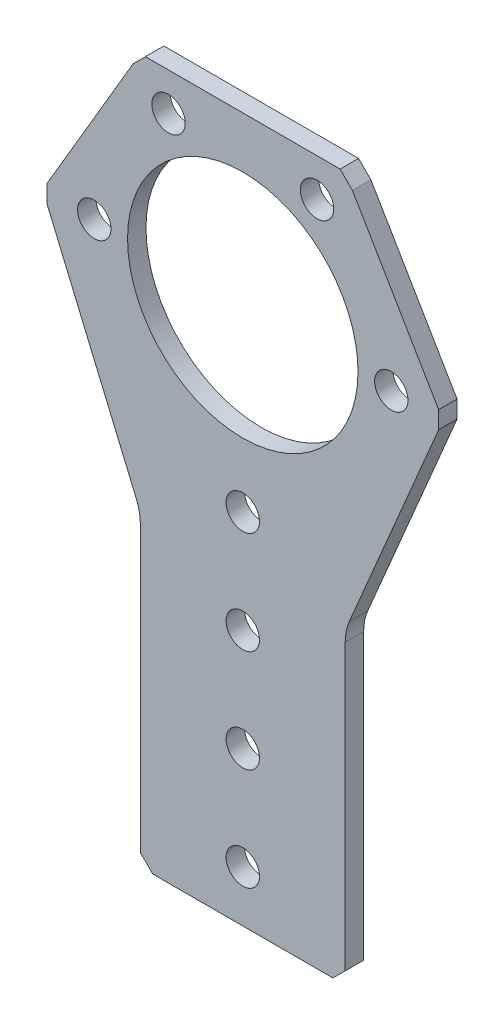
ISO-10303-21;
HEADER;
FILE_DESCRIPTION(('STEP AP214'),'2;1');
FILE_NAME('part.step','',(''),(''),'','','');
FILE_SCHEMA(('AUTOMOTIVE_DESIGN { 1 0 10303 214 1 1 1 1 }'));
ENDSEC;
DATA;
#1=APPLICATION_CONTEXT('core data for automotive mechanical design processes');
#2=APPLICATION_PROTOCOL_DEFINITION('international standard','automotive_design',2000,#1);
#3=PRODUCT_CONTEXT('',#1,'mechanical');
#4=PRODUCT('Part','Part','',(#3));
#5=PRODUCT_RELATED_PRODUCT_CATEGORY('part','',(#4));
#6=PRODUCT_DEFINITION_FORMATION('','',#4);
#7=PRODUCT_DEFINITION_CONTEXT('part definition',#1,'design');
#8=PRODUCT_DEFINITION('design','',#6,#7);
#9=PRODUCT_DEFINITION_SHAPE('','',#8);
#10=(LENGTH_UNIT() NAMED_UNIT(*) SI_UNIT(.MILLI.,.METRE.));
#11=(NAMED_UNIT(*) PLANE_ANGLE_UNIT() SI_UNIT($,.RADIAN.));
#12=(NAMED_UNIT(*) SI_UNIT($,.STERADIAN.) SOLID_ANGLE_UNIT());
#13=UNCERTAINTY_MEASURE_WITH_UNIT(LENGTH_MEASURE(1.E-05),#10,'distance_accuracy_value','');
#14=(GEOMETRIC_REPRESENTATION_CONTEXT(3) GLOBAL_UNCERTAINTY_ASSIGNED_CONTEXT((#13)) GLOBAL_UNIT_ASSIGNED_CONTEXT((#10,
#11,#12)) REPRESENTATION_CONTEXT('',''));
#15=CARTESIAN_POINT('',(0.,0.,0.));
#16=DIRECTION('',(0.,0.,1.));
#17=DIRECTION('',(1.,0.,0.));
#18=AXIS2_PLACEMENT_3D('',#15,#16,#17);
#19=CARTESIAN_POINT('',(-24.2821380930031,0.905387096774194,0.));
#20=DIRECTION('',(-1.,0.,0.));
#21=DIRECTION('',(0.,-1.,0.));
#22=AXIS2_PLACEMENT_3D('',#19,#20,#21);
#23=PLANE('',#22);
#24=DIRECTION('',(0.,-1.,0.));
#25=VECTOR('',#24,1.);
#26=CARTESIAN_POINT('',(-24.2821380930031,0.905387096774194,2.286));
#27=LINE('',#26,#25);
#28=CARTESIAN_POINT('',(-24.2821380930031,0.905387096774194,2.286));
#29=VERTEX_POINT('',#28);
#30=CARTESIAN_POINT('',(-24.2821380930031,-1.25361290322579,2.286));
#31=VERTEX_POINT('',#30);
#32=EDGE_CURVE('E177',#29,#31,#27,.T.);
#33=ORIENTED_EDGE('',*,*,#32,.F.);
#34=DIRECTION('',(0.,0.,1.));
#35=VECTOR('',#34,1.);
#36=CARTESIAN_POINT('',(-24.2821380930031,0.905387096774194,0.));
#37=LINE('',#36,#35);
#38=CARTESIAN_POINT('',(-24.2821380930031,0.905387096774194,0.));
#39=VERTEX_POINT('',#38);
#40=EDGE_CURVE('E11',#39,#29,#37,.T.);
#41=ORIENTED_EDGE('',*,*,#40,.F.);
#42=DIRECTION('',(0.,-1.,0.));
#43=VECTOR('',#42,1.);
#44=CARTESIAN_POINT('',(-24.2821380930031,0.905387096774194,0.));
#45=LINE('',#44,#43);
#46=CARTESIAN_POINT('',(-24.2821380930031,-1.25361290322579,0.));
#47=VERTEX_POINT('',#46);
#48=EDGE_CURVE('E222',#39,#47,#45,.T.);
#49=ORIENTED_EDGE('',*,*,#48,.T.);
#50=DIRECTION('',(0.,0.,1.));
#51=VECTOR('',#50,1.);
#52=CARTESIAN_POINT('',(-24.2821380930031,-1.25361290322579,0.));
#53=LINE('',#52,#51);
#54=EDGE_CURVE('E35',#47,#31,#53,.T.);
#55=ORIENTED_EDGE('',*,*,#54,.T.);
#56=EDGE_LOOP('',(#33,#41,#49,#55));
#57=FACE_BOUND('',#56,.T.);
#58=ADVANCED_FACE('F32',(#57),#23,.T.);
#59=CARTESIAN_POINT('',(-13.5960923947946,19.1108564594182,0.));
#60=DIRECTION('',(-0.862411095107785,0.506208556856748,0.));
#61=DIRECTION('',(-0.506208556856748,-0.862411095107785,0.));
#62=AXIS2_PLACEMENT_3D('',#59,#60,#61);
#63=PLANE('',#62);
#64=DIRECTION('',(-0.506208556856748,-0.862411095107785,0.));
#65=VECTOR('',#64,1.);
#66=CARTESIAN_POINT('',(-13.5960923947946,19.1108564594182,2.286));
#67=LINE('',#66,#65);
#68=CARTESIAN_POINT('',(-13.5960923947946,19.1108564594182,2.286));
#69=VERTEX_POINT('',#68);
#70=EDGE_CURVE('E220',#69,#29,#67,.T.);
#71=ORIENTED_EDGE('',*,*,#70,.F.);
#72=DIRECTION('',(0.,0.,1.));
#73=VECTOR('',#72,1.);
#74=CARTESIAN_POINT('',(-13.5960923947946,19.1108564594182,0.));
#75=LINE('',#74,#73);
#76=CARTESIAN_POINT('',(-13.5960923947946,19.1108564594182,0.));
#77=VERTEX_POINT('',#76);
#78=EDGE_CURVE('E41',#77,#69,#75,.T.);
#79=ORIENTED_EDGE('',*,*,#78,.F.);
#80=DIRECTION('',(-0.506208556856748,-0.862411095107785,0.));
#81=VECTOR('',#80,1.);
#82=CARTESIAN_POINT('',(-13.5960923947946,19.1108564594182,0.));
#83=LINE('',#82,#81);
#84=EDGE_CURVE('E167',#77,#39,#83,.T.);
#85=ORIENTED_EDGE('',*,*,#84,.T.);
#86=ORIENTED_EDGE('',*,*,#40,.T.);
#87=EDGE_LOOP('',(#71,#79,#85,#86));
#88=FACE_BOUND('',#87,.T.);
#89=ADVANCED_FACE('F250',(#88),#63,.T.);
#90=CARTESIAN_POINT('',(-12.0694488542129,20.6375,0.));
#91=DIRECTION('',(-0.707106781186553,0.707106781186542,0.));
#92=DIRECTION('',(-0.707106781186542,-0.707106781186553,0.));
#93=AXIS2_PLACEMENT_3D('',#90,#91,#92);
#94=PLANE('',#93);
#95=DIRECTION('',(-0.707106781186542,-0.707106781186553,0.));
#96=VECTOR('',#95,1.);
#97=CARTESIAN_POINT('',(-12.0694488542129,20.6375,2.286));
#98=LINE('',#97,#96);
#99=CARTESIAN_POINT('',(-12.0694488542129,20.6375,2.286));
#100=VERTEX_POINT('',#99);
#101=EDGE_CURVE('E154',#100,#69,#98,.T.);
#102=ORIENTED_EDGE('',*,*,#101,.F.);
#103=DIRECTION('',(0.,0.,1.));
#104=VECTOR('',#103,1.);
#105=CARTESIAN_POINT('',(-12.0694488542129,20.6375,0.));
#106=LINE('',#105,#104);
#107=CARTESIAN_POINT('',(-12.0694488542129,20.6375,0.));
#108=VERTEX_POINT('',#107);
#109=EDGE_CURVE('E149',#108,#100,#106,.T.);
#110=ORIENTED_EDGE('',*,*,#109,.F.);
#111=DIRECTION('',(-0.707106781186542,-0.707106781186553,0.));
#112=VECTOR('',#111,1.);
#113=CARTESIAN_POINT('',(-12.0694488542129,20.6375,0.));
#114=LINE('',#113,#112);
#115=EDGE_CURVE('E152',#108,#77,#114,.T.);
#116=ORIENTED_EDGE('',*,*,#115,.T.);
#117=ORIENTED_EDGE('',*,*,#78,.T.);
#118=EDGE_LOOP('',(#102,#110,#116,#117));
#119=FACE_BOUND('',#118,.T.);
#120=ADVANCED_FACE('F151',(#119),#94,.T.);
#121=CARTESIAN_POINT('',(12.0694488542128,20.6375,0.));
#122=DIRECTION('',(0.,1.,0.));
#123=DIRECTION('',(0.,0.,1.));
#124=AXIS2_PLACEMENT_3D('',#121,#122,#123);
#125=PLANE('',#124);
#126=DIRECTION('',(-1.,0.,0.));
#127=VECTOR('',#126,1.);
#128=CARTESIAN_POINT('',(12.0694488542128,20.6375,2.286));
#129=LINE('',#128,#127);
#130=CARTESIAN_POINT('',(12.0694488542128,20.6375,2.286));
#131=VERTEX_POINT('',#130);
#132=EDGE_CURVE('E217',#131,#100,#129,.T.);
#133=ORIENTED_EDGE('',*,*,#132,.F.);
#134=DIRECTION('',(0.,0.,1.));
#135=VECTOR('',#134,1.);
#136=CARTESIAN_POINT('',(12.0694488542128,20.6375,0.));
#137=LINE('',#136,#135);
#138=CARTESIAN_POINT('',(12.0694488542128,20.6375,0.));
#139=VERTEX_POINT('',#138);
#140=EDGE_CURVE('E159',#139,#131,#137,.T.);
#141=ORIENTED_EDGE('',*,*,#140,.F.);
#142=DIRECTION('',(-1.,0.,0.));
#143=VECTOR('',#142,1.);
#144=CARTESIAN_POINT('',(12.0694488542128,20.6375,0.));
#145=LINE('',#144,#143);
#146=EDGE_CURVE('E165',#139,#108,#145,.T.);
#147=ORIENTED_EDGE('',*,*,#146,.T.);
#148=ORIENTED_EDGE('',*,*,#109,.T.);
#149=EDGE_LOOP('',(#133,#141,#147,#148));
#150=FACE_BOUND('',#149,.T.);
#151=ADVANCED_FACE('F169',(#150),#125,.T.);
#152=CARTESIAN_POINT('',(13.5960923947946,19.1108564594183,0.));
#153=DIRECTION('',(0.707106781186537,0.707106781186558,0.));
#154=DIRECTION('',(-0.707106781186558,0.707106781186537,0.));
#155=AXIS2_PLACEMENT_3D('',#152,#153,#154);
#156=PLANE('',#155);
#157=DIRECTION('',(-0.707106781186558,0.707106781186538,0.));
#158=VECTOR('',#157,1.);
#159=CARTESIAN_POINT('',(13.5960923947946,19.1108564594183,2.286));
#160=LINE('',#159,#158);
#161=CARTESIAN_POINT('',(13.5960923947946,19.1108564594183,2.286));
#162=VERTEX_POINT('',#161);
#163=EDGE_CURVE('E214',#162,#131,#160,.T.);
#164=ORIENTED_EDGE('',*,*,#163,.F.);
#165=DIRECTION('',(0.,0.,1.));
#166=VECTOR('',#165,1.);
#167=CARTESIAN_POINT('',(13.5960923947946,19.1108564594183,0.));
#168=LINE('',#167,#166);
#169=CARTESIAN_POINT('',(13.5960923947946,19.1108564594183,0.));
#170=VERTEX_POINT('',#169);
#171=EDGE_CURVE('E226',#170,#162,#168,.T.);
#172=ORIENTED_EDGE('',*,*,#171,.F.);
#173=DIRECTION('',(-0.707106781186558,0.707106781186538,0.));
#174=VECTOR('',#173,1.);
#175=CARTESIAN_POINT('',(13.5960923947946,19.1108564594183,0.));
#176=LINE('',#175,#174);
#177=EDGE_CURVE('E170',#170,#139,#176,.T.);
#178=ORIENTED_EDGE('',*,*,#177,.T.);
#179=ORIENTED_EDGE('',*,*,#140,.T.);
#180=EDGE_LOOP('',(#164,#172,#178,#179));
#181=FACE_BOUND('',#180,.T.);
#182=ADVANCED_FACE('F263',(#181),#156,.T.);
#183=CARTESIAN_POINT('',(24.2821380930031,0.905387096774183,0.));
#184=DIRECTION('',(0.862411095107785,0.506208556856748,0.));
#185=DIRECTION('',(-0.506208556856748,0.862411095107785,0.));
#186=AXIS2_PLACEMENT_3D('',#183,#184,#185);
#187=PLANE('',#186);
#188=DIRECTION('',(-0.506208556856748,0.862411095107785,0.));
#189=VECTOR('',#188,1.);
#190=CARTESIAN_POINT('',(24.2821380930031,0.905387096774183,2.286));
#191=LINE('',#190,#189);
#192=CARTESIAN_POINT('',(24.2821380930031,0.905387096774183,2.286));
#193=VERTEX_POINT('',#192);
#194=EDGE_CURVE('E211',#193,#162,#191,.T.);
#195=ORIENTED_EDGE('',*,*,#194,.F.);
#196=DIRECTION('',(0.,0.,1.));
#197=VECTOR('',#196,1.);
#198=CARTESIAN_POINT('',(24.2821380930031,0.905387096774183,0.));
#199=LINE('',#198,#197);
#200=CARTESIAN_POINT('',(24.2821380930031,0.905387096774183,0.));
#201=VERTEX_POINT('',#200);
#202=EDGE_CURVE('E228',#201,#193,#199,.T.);
#203=ORIENTED_EDGE('',*,*,#202,.F.);
#204=DIRECTION('',(-0.506208556856748,0.862411095107785,0.));
#205=VECTOR('',#204,1.);
#206=CARTESIAN_POINT('',(24.2821380930031,0.905387096774183,0.));
#207=LINE('',#206,#205);
#208=EDGE_CURVE('E172',#201,#170,#207,.T.);
#209=ORIENTED_EDGE('',*,*,#208,.T.);
#210=ORIENTED_EDGE('',*,*,#171,.T.);
#211=EDGE_LOOP('',(#195,#203,#209,#210));
#212=FACE_BOUND('',#211,.T.);
#213=ADVANCED_FACE('F266',(#212),#187,.T.);
#214=CARTESIAN_POINT('',(24.282138093003,-1.25361290322581,0.));
#215=DIRECTION('',(1.,0.,0.));
#216=DIRECTION('',(0.,1.,0.));
#217=AXIS2_PLACEMENT_3D('',#214,#215,#216);
#218=PLANE('',#217);
#219=DIRECTION('',(0.,1.,0.));
#220=VECTOR('',#219,1.);
#221=CARTESIAN_POINT('',(24.282138093003,-1.25361290322581,2.286));
#222=LINE('',#221,#220);
#223=CARTESIAN_POINT('',(24.282138093003,-1.25361290322581,2.286));
#224=VERTEX_POINT('',#223);
#225=EDGE_CURVE('E208',#224,#193,#222,.T.);
#226=ORIENTED_EDGE('',*,*,#225,.F.);
#227=DIRECTION('',(0.,0.,1.));
#228=VECTOR('',#227,1.);
#229=CARTESIAN_POINT('',(24.282138093003,-1.25361290322581,0.));
#230=LINE('',#229,#228);
#231=CARTESIAN_POINT('',(24.282138093003,-1.25361290322581,0.));
#232=VERTEX_POINT('',#231);
#233=EDGE_CURVE('E230',#232,#224,#230,.T.);
#234=ORIENTED_EDGE('',*,*,#233,.F.);
#235=DIRECTION('',(0.,1.,0.));
#236=VECTOR('',#235,1.);
#237=CARTESIAN_POINT('',(24.282138093003,-1.25361290322581,0.));
#238=LINE('',#237,#236);
#239=EDGE_CURVE('E438',#232,#201,#238,.T.);
#240=ORIENTED_EDGE('',*,*,#239,.T.);
#241=ORIENTED_EDGE('',*,*,#202,.T.);
#242=EDGE_LOOP('',(#226,#234,#240,#241));
#243=FACE_BOUND('',#242,.T.);
#244=ADVANCED_FACE('F270',(#243),#218,.T.);
#245=CARTESIAN_POINT('',(13.2036324602901,-27.3869691466639,0.));
#246=DIRECTION('',(0.920687801529116,-0.390299848982142,0.));
#247=DIRECTION('',(0.390299848982142,0.920687801529116,0.));
#248=AXIS2_PLACEMENT_3D('',#245,#246,#247);
#249=PLANE('',#248);
#250=DIRECTION('',(0.390299848982142,0.920687801529116,0.));
#251=VECTOR('',#250,1.);
#252=CARTESIAN_POINT('',(13.2036324602901,-27.3869691466639,2.286));
#253=LINE('',#252,#251);
#254=CARTESIAN_POINT('',(13.2036324602901,-27.3869691466639,2.286));
#255=VERTEX_POINT('',#254);
#256=EDGE_CURVE('E205',#255,#224,#253,.T.);
#257=ORIENTED_EDGE('',*,*,#256,.F.);
#258=DIRECTION('',(0.,0.,1.));
#259=VECTOR('',#258,1.);
#260=CARTESIAN_POINT('',(13.2036324602901,-27.3869691466639,0.));
#261=LINE('',#260,#259);
#262=CARTESIAN_POINT('',(13.2036324602901,-27.3869691466639,0.));
#263=VERTEX_POINT('',#262);
#264=EDGE_CURVE('E232',#263,#255,#261,.T.);
#265=ORIENTED_EDGE('',*,*,#264,.F.);
#266=DIRECTION('',(0.390299848982142,0.920687801529116,0.));
#267=VECTOR('',#266,1.);
#268=CARTESIAN_POINT('',(13.2036324602901,-27.3869691466639,0.));
#269=LINE('',#268,#267);
#270=EDGE_CURVE('E435',#263,#232,#269,.T.);
#271=ORIENTED_EDGE('',*,*,#270,.T.);
#272=ORIENTED_EDGE('',*,*,#233,.T.);
#273=EDGE_LOOP('',(#257,#265,#271,#272));
#274=FACE_BOUND('',#273,.T.);
#275=ADVANCED_FACE('F274',(#274),#249,.T.);
#276=CARTESIAN_POINT('',(19.05,-29.8653731877005,0.));
#277=DIRECTION('',(0.,0.,1.));
#278=DIRECTION('',(1.,0.,0.));
#279=AXIS2_PLACEMENT_3D('',#276,#277,#278);
#280=CYLINDRICAL_SURFACE('',#279,6.35);
#281=CARTESIAN_POINT('',(19.05,-29.8653731877005,2.286));
#282=DIRECTION('',(0.,0.,-1.));
#283=DIRECTION('',(-1.,0.,0.));
#284=AXIS2_PLACEMENT_3D('',#281,#282,#283);
#285=CIRCLE('',#284,6.35);
#286=CARTESIAN_POINT('',(12.7,-29.8653731877005,2.286));
#287=VERTEX_POINT('',#286);
#288=EDGE_CURVE('E202',#287,#255,#285,.T.);
#289=ORIENTED_EDGE('',*,*,#288,.F.);
#290=DIRECTION('',(0.,0.,1.));
#291=VECTOR('',#290,1.);
#292=CARTESIAN_POINT('',(12.7,-29.8653731877005,0.));
#293=LINE('',#292,#291);
#294=CARTESIAN_POINT('',(12.7,-29.8653731877005,0.));
#295=VERTEX_POINT('',#294);
#296=EDGE_CURVE('E234',#295,#287,#293,.T.);
#297=ORIENTED_EDGE('',*,*,#296,.F.);
#298=CARTESIAN_POINT('',(19.05,-29.8653731877005,0.));
#299=DIRECTION('',(0.,0.,-1.));
#300=DIRECTION('',(-1.,0.,0.));
#301=AXIS2_PLACEMENT_3D('',#298,#299,#300);
#302=CIRCLE('',#301,6.35);
#303=EDGE_CURVE('E432',#295,#263,#302,.T.);
#304=ORIENTED_EDGE('',*,*,#303,.T.);
#305=ORIENTED_EDGE('',*,*,#264,.T.);
#306=EDGE_LOOP('',(#289,#297,#304,#305));
#307=FACE_BOUND('',#306,.T.);
#308=ADVANCED_FACE('F278',(#307),#280,.F.);
#309=CARTESIAN_POINT('',(12.7,-65.1483564594182,0.));
#310=DIRECTION('',(1.,0.,0.));
#311=DIRECTION('',(0.,1.,0.));
#312=AXIS2_PLACEMENT_3D('',#309,#310,#311);
#313=PLANE('',#312);
#314=DIRECTION('',(0.,1.,0.));
#315=VECTOR('',#314,1.);
#316=CARTESIAN_POINT('',(12.7,-65.1483564594182,2.286));
#317=LINE('',#316,#315);
#318=CARTESIAN_POINT('',(12.7,-65.1483564594182,2.286));
#319=VERTEX_POINT('',#318);
#320=EDGE_CURVE('E199',#319,#287,#317,.T.);
#321=ORIENTED_EDGE('',*,*,#320,.F.);
#322=DIRECTION('',(0.,0.,1.));
#323=VECTOR('',#322,1.);
#324=CARTESIAN_POINT('',(12.7,-65.1483564594182,0.));
#325=LINE('',#324,#323);
#326=CARTESIAN_POINT('',(12.7,-65.1483564594182,0.));
#327=VERTEX_POINT('',#326);
#328=EDGE_CURVE('E236',#327,#319,#325,.T.);
#329=ORIENTED_EDGE('',*,*,#328,.F.);
#330=DIRECTION('',(0.,1.,0.));
#331=VECTOR('',#330,1.);
#332=CARTESIAN_POINT('',(12.7,-65.1483564594182,0.));
#333=LINE('',#332,#331);
#334=EDGE_CURVE('E429',#327,#295,#333,.T.);
#335=ORIENTED_EDGE('',*,*,#334,.T.);
#336=ORIENTED_EDGE('',*,*,#296,.T.);
#337=EDGE_LOOP('',(#321,#329,#335,#336));
#338=FACE_BOUND('',#337,.T.);
#339=ADVANCED_FACE('F282',(#338),#313,.T.);
#340=CARTESIAN_POINT('',(11.1733564594183,-66.675,0.));
#341=DIRECTION('',(0.707106781186556,-0.707106781186539,0.));
#342=DIRECTION('',(0.707106781186539,0.707106781186556,0.));
#343=AXIS2_PLACEMENT_3D('',#340,#341,#342);
#344=PLANE('',#343);
#345=DIRECTION('',(0.707106781186539,0.707106781186556,0.));
#346=VECTOR('',#345,1.);
#347=CARTESIAN_POINT('',(11.1733564594183,-66.675,2.286));
#348=LINE('',#347,#346);
#349=CARTESIAN_POINT('',(11.1733564594183,-66.675,2.286));
#350=VERTEX_POINT('',#349);
#351=EDGE_CURVE('E196',#350,#319,#348,.T.);
#352=ORIENTED_EDGE('',*,*,#351,.F.);
#353=DIRECTION('',(0.,0.,1.));
#354=VECTOR('',#353,1.);
#355=CARTESIAN_POINT('',(11.1733564594183,-66.675,0.));
#356=LINE('',#355,#354);
#357=CARTESIAN_POINT('',(11.1733564594183,-66.675,0.));
#358=VERTEX_POINT('',#357);
#359=EDGE_CURVE('E238',#358,#350,#356,.T.);
#360=ORIENTED_EDGE('',*,*,#359,.F.);
#361=DIRECTION('',(0.707106781186539,0.707106781186556,0.));
#362=VECTOR('',#361,1.);
#363=CARTESIAN_POINT('',(11.1733564594183,-66.675,0.));
#364=LINE('',#363,#362);
#365=EDGE_CURVE('E426',#358,#327,#364,.T.);
#366=ORIENTED_EDGE('',*,*,#365,.T.);
#367=ORIENTED_EDGE('',*,*,#328,.T.);
#368=EDGE_LOOP('',(#352,#360,#366,#367));
#369=FACE_BOUND('',#368,.T.);
#370=ADVANCED_FACE('F286',(#369),#344,.T.);
#371=CARTESIAN_POINT('',(-11.1733564594182,-66.675,0.));
#372=DIRECTION('',(0.,-1.,0.));
#373=DIRECTION('',(1.,0.,0.));
#374=AXIS2_PLACEMENT_3D('',#371,#372,#373);
#375=PLANE('',#374);
#376=DIRECTION('',(1.,0.,0.));
#377=VECTOR('',#376,1.);
#378=CARTESIAN_POINT('',(-11.1733564594182,-66.675,2.286));
#379=LINE('',#378,#377);
#380=CARTESIAN_POINT('',(-11.1733564594182,-66.675,2.286));
#381=VERTEX_POINT('',#380);
#382=EDGE_CURVE('E193',#381,#350,#379,.T.);
#383=ORIENTED_EDGE('',*,*,#382,.F.);
#384=DIRECTION('',(0.,0.,1.));
#385=VECTOR('',#384,1.);
#386=CARTESIAN_POINT('',(-11.1733564594182,-66.675,0.));
#387=LINE('',#386,#385);
#388=CARTESIAN_POINT('',(-11.1733564594182,-66.675,0.));
#389=VERTEX_POINT('',#388);
#390=EDGE_CURVE('E240',#389,#381,#387,.T.);
#391=ORIENTED_EDGE('',*,*,#390,.F.);
#392=DIRECTION('',(1.,0.,0.));
#393=VECTOR('',#392,1.);
#394=CARTESIAN_POINT('',(-11.1733564594182,-66.675,0.));
#395=LINE('',#394,#393);
#396=EDGE_CURVE('E423',#389,#358,#395,.T.);
#397=ORIENTED_EDGE('',*,*,#396,.T.);
#398=ORIENTED_EDGE('',*,*,#359,.T.);
#399=EDGE_LOOP('',(#383,#391,#397,#398));
#400=FACE_BOUND('',#399,.T.);
#401=ADVANCED_FACE('F290',(#400),#375,.T.);
#402=CARTESIAN_POINT('',(-12.7,-65.1483564594183,0.));
#403=DIRECTION('',(-0.707106781186541,-0.707106781186554,0.));
#404=DIRECTION('',(0.707106781186554,-0.707106781186541,0.));
#405=AXIS2_PLACEMENT_3D('',#402,#403,#404);
#406=PLANE('',#405);
#407=DIRECTION('',(0.707106781186554,-0.707106781186541,0.));
#408=VECTOR('',#407,1.);
#409=CARTESIAN_POINT('',(-12.7,-65.1483564594183,2.286));
#410=LINE('',#409,#408);
#411=CARTESIAN_POINT('',(-12.7,-65.1483564594183,2.286));
#412=VERTEX_POINT('',#411);
#413=EDGE_CURVE('E190',#412,#381,#410,.T.);
#414=ORIENTED_EDGE('',*,*,#413,.F.);
#415=DIRECTION('',(0.,0.,1.));
#416=VECTOR('',#415,1.);
#417=CARTESIAN_POINT('',(-12.7,-65.1483564594183,0.));
#418=LINE('',#417,#416);
#419=CARTESIAN_POINT('',(-12.7,-65.1483564594183,0.));
#420=VERTEX_POINT('',#419);
#421=EDGE_CURVE('E242',#420,#412,#418,.T.);
#422=ORIENTED_EDGE('',*,*,#421,.F.);
#423=DIRECTION('',(0.707106781186554,-0.707106781186541,0.));
#424=VECTOR('',#423,1.);
#425=CARTESIAN_POINT('',(-12.7,-65.1483564594183,0.));
#426=LINE('',#425,#424);
#427=EDGE_CURVE('E420',#420,#389,#426,.T.);
#428=ORIENTED_EDGE('',*,*,#427,.T.);
#429=ORIENTED_EDGE('',*,*,#390,.T.);
#430=EDGE_LOOP('',(#414,#422,#428,#429));
#431=FACE_BOUND('',#430,.T.);
#432=ADVANCED_FACE('F294',(#431),#406,.T.);
#433=CARTESIAN_POINT('',(-12.7,-29.8653731877005,0.));
#434=DIRECTION('',(-1.,0.,0.));
#435=DIRECTION('',(0.,-1.,0.));
#436=AXIS2_PLACEMENT_3D('',#433,#434,#435);
#437=PLANE('',#436);
#438=DIRECTION('',(0.,-1.,0.));
#439=VECTOR('',#438,1.);
#440=CARTESIAN_POINT('',(-12.7,-29.8653731877005,2.286));
#441=LINE('',#440,#439);
#442=CARTESIAN_POINT('',(-12.7,-29.8653731877005,2.286));
#443=VERTEX_POINT('',#442);
#444=EDGE_CURVE('E187',#443,#412,#441,.T.);
#445=ORIENTED_EDGE('',*,*,#444,.F.);
#446=DIRECTION('',(0.,0.,1.));
#447=VECTOR('',#446,1.);
#448=CARTESIAN_POINT('',(-12.7,-29.8653731877005,0.));
#449=LINE('',#448,#447);
#450=CARTESIAN_POINT('',(-12.7,-29.8653731877005,0.));
#451=VERTEX_POINT('',#450);
#452=EDGE_CURVE('E244',#451,#443,#449,.T.);
#453=ORIENTED_EDGE('',*,*,#452,.F.);
#454=DIRECTION('',(0.,-1.,0.));
#455=VECTOR('',#454,1.);
#456=CARTESIAN_POINT('',(-12.7,-29.8653731877005,0.));
#457=LINE('',#456,#455);
#458=EDGE_CURVE('E417',#451,#420,#457,.T.);
#459=ORIENTED_EDGE('',*,*,#458,.T.);
#460=ORIENTED_EDGE('',*,*,#421,.T.);
#461=EDGE_LOOP('',(#445,#453,#459,#460));
#462=FACE_BOUND('',#461,.T.);
#463=ADVANCED_FACE('F298',(#462),#437,.T.);
#464=CARTESIAN_POINT('',(-19.05,-29.8653731877005,0.));
#465=DIRECTION('',(0.,0.,1.));
#466=DIRECTION('',(1.,0.,0.));
#467=AXIS2_PLACEMENT_3D('',#464,#465,#466);
#468=CYLINDRICAL_SURFACE('',#467,6.35);
#469=CARTESIAN_POINT('',(-19.05,-29.8653731877005,2.286));
#470=DIRECTION('',(0.,0.,-1.));
#471=DIRECTION('',(-1.,0.,0.));
#472=AXIS2_PLACEMENT_3D('',#469,#470,#471);
#473=CIRCLE('',#472,6.35);
#474=CARTESIAN_POINT('',(-13.2036324602901,-27.3869691466639,2.286));
#475=VERTEX_POINT('',#474);
#476=EDGE_CURVE('E184',#475,#443,#473,.T.);
#477=ORIENTED_EDGE('',*,*,#476,.F.);
#478=DIRECTION('',(0.,0.,1.));
#479=VECTOR('',#478,1.);
#480=CARTESIAN_POINT('',(-13.2036324602901,-27.3869691466639,0.));
#481=LINE('',#480,#479);
#482=CARTESIAN_POINT('',(-13.2036324602901,-27.3869691466639,0.));
#483=VERTEX_POINT('',#482);
#484=EDGE_CURVE('E245',#483,#475,#481,.T.);
#485=ORIENTED_EDGE('',*,*,#484,.F.);
#486=CARTESIAN_POINT('',(-19.05,-29.8653731877005,0.));
#487=DIRECTION('',(0.,0.,-1.));
#488=DIRECTION('',(-1.,0.,0.));
#489=AXIS2_PLACEMENT_3D('',#486,#487,#488);
#490=CIRCLE('',#489,6.35);
#491=EDGE_CURVE('E414',#483,#451,#490,.T.);
#492=ORIENTED_EDGE('',*,*,#491,.T.);
#493=ORIENTED_EDGE('',*,*,#452,.T.);
#494=EDGE_LOOP('',(#477,#485,#492,#493));
#495=FACE_BOUND('',#494,.T.);
#496=ADVANCED_FACE('F302',(#495),#468,.F.);
#497=CARTESIAN_POINT('',(-24.2821380930031,-1.25361290322579,0.));
#498=DIRECTION('',(-0.920687801529116,-0.390299848982142,0.));
#499=DIRECTION('',(0.390299848982142,-0.920687801529116,0.));
#500=AXIS2_PLACEMENT_3D('',#497,#498,#499);
#501=PLANE('',#500);
#502=DIRECTION('',(0.390299848982142,-0.920687801529116,0.));
#503=VECTOR('',#502,1.);
#504=CARTESIAN_POINT('',(-24.2821380930031,-1.25361290322579,2.286));
#505=LINE('',#504,#503);
#506=EDGE_CURVE('E180',#31,#475,#505,.T.);
#507=ORIENTED_EDGE('',*,*,#506,.F.);
#508=ORIENTED_EDGE('',*,*,#54,.F.);
#509=DIRECTION('',(0.390299848982142,-0.920687801529116,0.));
#510=VECTOR('',#509,1.);
#511=CARTESIAN_POINT('',(-24.2821380930031,-1.25361290322579,0.));
#512=LINE('',#511,#510);
#513=EDGE_CURVE('E412',#47,#483,#512,.T.);
#514=ORIENTED_EDGE('',*,*,#513,.T.);
#515=ORIENTED_EDGE('',*,*,#484,.T.);
#516=EDGE_LOOP('',(#507,#508,#514,#515));
#517=FACE_BOUND('',#516,.T.);
#518=ADVANCED_FACE('F247',(#517),#501,.T.);
#519=CARTESIAN_POINT('',(-19.05,-29.8653731877005,0.));
#520=DIRECTION('',(0.,0.,-1.));
#521=DIRECTION('',(-1.,0.,0.));
#522=AXIS2_PLACEMENT_3D('',#519,#520,#521);
#523=PLANE('',#522);
#524=CARTESIAN_POINT('',(9.20750000000008,15.9478578106904,0.));
#525=DIRECTION('',(0.,0.,1.));
#526=DIRECTION('',(-1.,0.,0.));
#527=AXIS2_PLACEMENT_3D('',#524,#525,#526);
#528=CIRCLE('',#527,2.0701);
#529=CARTESIAN_POINT('',(7.13740000000008,15.9478578106904,0.));
#530=VERTEX_POINT('',#529);
#531=EDGE_CURVE('E357',#530,#530,#528,.T.);
#532=ORIENTED_EDGE('',*,*,#531,.T.);
#533=EDGE_LOOP('',(#532));
#534=FACE_BOUND('',#533,.T.);
#535=CARTESIAN_POINT('',(18.415,0.,0.));
#536=DIRECTION('',(0.,0.,1.));
#537=DIRECTION('',(-1.,0.,0.));
#538=AXIS2_PLACEMENT_3D('',#535,#536,#537);
#539=CIRCLE('',#538,2.0701);
#540=CARTESIAN_POINT('',(16.3449,0.,0.));
#541=VERTEX_POINT('',#540);
#542=EDGE_CURVE('E365',#541,#541,#539,.T.);
#543=ORIENTED_EDGE('',*,*,#542,.T.);
#544=EDGE_LOOP('',(#543));
#545=FACE_BOUND('',#544,.T.);
#546=CARTESIAN_POINT('',(3.9907631702977E-13,-60.325,0.));
#547=DIRECTION('',(0.,0.,1.));
#548=DIRECTION('',(-1.,0.,0.));
#549=AXIS2_PLACEMENT_3D('',#546,#547,#548);
#550=CIRCLE('',#549,2.0701);
#551=CARTESIAN_POINT('',(-2.0700999999996,-60.325,0.));
#552=VERTEX_POINT('',#551);
#553=EDGE_CURVE('E371',#552,#552,#550,.T.);
#554=ORIENTED_EDGE('',*,*,#553,.T.);
#555=EDGE_LOOP('',(#554));
#556=FACE_BOUND('',#555,.T.);
#557=CARTESIAN_POINT('',(1.33025439009923E-13,-34.925,0.));
#558=DIRECTION('',(0.,0.,1.));
#559=DIRECTION('',(-1.,0.,0.));
#560=AXIS2_PLACEMENT_3D('',#557,#558,#559);
#561=CIRCLE('',#560,2.0701);
#562=CARTESIAN_POINT('',(-2.07009999999987,-34.925,0.));
#563=VERTEX_POINT('',#562);
#564=EDGE_CURVE('E377',#563,#563,#561,.T.);
#565=ORIENTED_EDGE('',*,*,#564,.T.);
#566=EDGE_LOOP('',(#565));
#567=FACE_BOUND('',#566,.T.);
#568=CARTESIAN_POINT('',(0.,0.,0.));
#569=DIRECTION('',(0.,0.,1.));
#570=DIRECTION('',(-1.,0.,0.));
#571=AXIS2_PLACEMENT_3D('',#568,#569,#570);
#572=CIRCLE('',#571,14.2875);
#573=CARTESIAN_POINT('',(-14.2875,0.,0.));
#574=VERTEX_POINT('',#573);
#575=EDGE_CURVE('E383',#574,#574,#572,.T.);
#576=ORIENTED_EDGE('',*,*,#575,.T.);
#577=EDGE_LOOP('',(#576));
#578=FACE_BOUND('',#577,.T.);
#579=CARTESIAN_POINT('',(0.,-22.225,0.));
#580=DIRECTION('',(0.,0.,1.));
#581=DIRECTION('',(-1.,0.,0.));
#582=AXIS2_PLACEMENT_3D('',#579,#580,#581);
#583=CIRCLE('',#582,2.0701);
#584=CARTESIAN_POINT('',(-2.0701,-22.225,0.));
#585=VERTEX_POINT('',#584);
#586=EDGE_CURVE('E389',#585,#585,#583,.T.);
#587=ORIENTED_EDGE('',*,*,#586,.T.);
#588=EDGE_LOOP('',(#587));
#589=FACE_BOUND('',#588,.T.);
#590=CARTESIAN_POINT('',(2.66050878019847E-13,-47.625,0.));
#591=DIRECTION('',(0.,0.,1.));
#592=DIRECTION('',(-1.,0.,0.));
#593=AXIS2_PLACEMENT_3D('',#590,#591,#592);
#594=CIRCLE('',#593,2.0701);
#595=CARTESIAN_POINT('',(-2.07009999999973,-47.625,0.));
#596=VERTEX_POINT('',#595);
#597=EDGE_CURVE('E395',#596,#596,#594,.T.);
#598=ORIENTED_EDGE('',*,*,#597,.T.);
#599=EDGE_LOOP('',(#598));
#600=FACE_BOUND('',#599,.T.);
#601=CARTESIAN_POINT('',(-18.415,0.,0.));
#602=DIRECTION('',(0.,0.,1.));
#603=DIRECTION('',(-1.,0.,0.));
#604=AXIS2_PLACEMENT_3D('',#601,#602,#603);
#605=CIRCLE('',#604,2.0701);
#606=CARTESIAN_POINT('',(-20.4851,0.,0.));
#607=VERTEX_POINT('',#606);
#608=EDGE_CURVE('E401',#607,#607,#605,.T.);
#609=ORIENTED_EDGE('',*,*,#608,.T.);
#610=EDGE_LOOP('',(#609));
#611=FACE_BOUND('',#610,.T.);
#612=CARTESIAN_POINT('',(-9.20749999999996,15.9478578106905,0.));
#613=DIRECTION('',(0.,0.,1.));
#614=DIRECTION('',(-1.,0.,0.));
#615=AXIS2_PLACEMENT_3D('',#612,#613,#614);
#616=CIRCLE('',#615,2.0701);
#617=CARTESIAN_POINT('',(-11.2776,15.9478578106905,0.));
#618=VERTEX_POINT('',#617);
#619=EDGE_CURVE('E181',#618,#618,#616,.T.);
#620=ORIENTED_EDGE('',*,*,#619,.T.);
#621=EDGE_LOOP('',(#620));
#622=FACE_BOUND('',#621,.T.);
#623=ORIENTED_EDGE('',*,*,#48,.F.);
#624=ORIENTED_EDGE('',*,*,#84,.F.);
#625=ORIENTED_EDGE('',*,*,#115,.F.);
#626=ORIENTED_EDGE('',*,*,#146,.F.);
#627=ORIENTED_EDGE('',*,*,#177,.F.);
#628=ORIENTED_EDGE('',*,*,#208,.F.);
#629=ORIENTED_EDGE('',*,*,#239,.F.);
#630=ORIENTED_EDGE('',*,*,#270,.F.);
#631=ORIENTED_EDGE('',*,*,#303,.F.);
#632=ORIENTED_EDGE('',*,*,#334,.F.);
#633=ORIENTED_EDGE('',*,*,#365,.F.);
#634=ORIENTED_EDGE('',*,*,#396,.F.);
#635=ORIENTED_EDGE('',*,*,#427,.F.);
#636=ORIENTED_EDGE('',*,*,#458,.F.);
#637=ORIENTED_EDGE('',*,*,#491,.F.);
#638=ORIENTED_EDGE('',*,*,#513,.F.);
#639=EDGE_LOOP('',(#623,#624,#625,#626,#627,#628,#629,#630,#631,#632,#633,#634,#635,#636,#637,#638));
#640=FACE_BOUND('',#639,.T.);
#641=ADVANCED_FACE('F163',(#534,#545,#556,#567,#578,#589,#600,#611,#622,#640),#523,.T.);
#642=CARTESIAN_POINT('',(-19.05,-29.8653731877005,2.286));
#643=DIRECTION('',(0.,0.,-1.));
#644=DIRECTION('',(-1.,0.,0.));
#645=AXIS2_PLACEMENT_3D('',#642,#643,#644);
#646=PLANE('',#645);
#647=CARTESIAN_POINT('',(9.20750000000008,15.9478578106904,2.286));
#648=DIRECTION('',(0.,0.,1.));
#649=DIRECTION('',(-1.,0.,0.));
#650=AXIS2_PLACEMENT_3D('',#647,#648,#649);
#651=CIRCLE('',#650,2.0701);
#652=CARTESIAN_POINT('',(7.13740000000008,15.9478578106904,2.286));
#653=VERTEX_POINT('',#652);
#654=EDGE_CURVE('E360',#653,#653,#651,.T.);
#655=ORIENTED_EDGE('',*,*,#654,.F.);
#656=EDGE_LOOP('',(#655));
#657=FACE_BOUND('',#656,.T.);
#658=CARTESIAN_POINT('',(18.415,0.,2.286));
#659=DIRECTION('',(0.,0.,1.));
#660=DIRECTION('',(-1.,0.,0.));
#661=AXIS2_PLACEMENT_3D('',#658,#659,#660);
#662=CIRCLE('',#661,2.0701);
#663=CARTESIAN_POINT('',(16.3449,0.,2.286));
#664=VERTEX_POINT('',#663);
#665=EDGE_CURVE('E362',#664,#664,#662,.T.);
#666=ORIENTED_EDGE('',*,*,#665,.F.);
#667=EDGE_LOOP('',(#666));
#668=FACE_BOUND('',#667,.T.);
#669=CARTESIAN_POINT('',(3.9907631702977E-13,-60.325,2.286));
#670=DIRECTION('',(0.,0.,1.));
#671=DIRECTION('',(-1.,0.,0.));
#672=AXIS2_PLACEMENT_3D('',#669,#670,#671);
#673=CIRCLE('',#672,2.0701);
#674=CARTESIAN_POINT('',(-2.0700999999996,-60.325,2.286));
#675=VERTEX_POINT('',#674);
#676=EDGE_CURVE('E368',#675,#675,#673,.T.);
#677=ORIENTED_EDGE('',*,*,#676,.F.);
#678=EDGE_LOOP('',(#677));
#679=FACE_BOUND('',#678,.T.);
#680=CARTESIAN_POINT('',(1.33025439009923E-13,-34.925,2.286));
#681=DIRECTION('',(0.,0.,1.));
#682=DIRECTION('',(-1.,0.,0.));
#683=AXIS2_PLACEMENT_3D('',#680,#681,#682);
#684=CIRCLE('',#683,2.0701);
#685=CARTESIAN_POINT('',(-2.07009999999987,-34.925,2.286));
#686=VERTEX_POINT('',#685);
#687=EDGE_CURVE('E374',#686,#686,#684,.T.);
#688=ORIENTED_EDGE('',*,*,#687,.F.);
#689=EDGE_LOOP('',(#688));
#690=FACE_BOUND('',#689,.T.);
#691=CARTESIAN_POINT('',(0.,0.,2.286));
#692=DIRECTION('',(0.,0.,1.));
#693=DIRECTION('',(-1.,0.,0.));
#694=AXIS2_PLACEMENT_3D('',#691,#692,#693);
#695=CIRCLE('',#694,14.2875);
#696=CARTESIAN_POINT('',(-14.2875,0.,2.286));
#697=VERTEX_POINT('',#696);
#698=EDGE_CURVE('E380',#697,#697,#695,.T.);
#699=ORIENTED_EDGE('',*,*,#698,.F.);
#700=EDGE_LOOP('',(#699));
#701=FACE_BOUND('',#700,.T.);
#702=CARTESIAN_POINT('',(0.,-22.225,2.286));
#703=DIRECTION('',(0.,0.,1.));
#704=DIRECTION('',(-1.,0.,0.));
#705=AXIS2_PLACEMENT_3D('',#702,#703,#704);
#706=CIRCLE('',#705,2.0701);
#707=CARTESIAN_POINT('',(-2.0701,-22.225,2.286));
#708=VERTEX_POINT('',#707);
#709=EDGE_CURVE('E386',#708,#708,#706,.T.);
#710=ORIENTED_EDGE('',*,*,#709,.F.);
#711=EDGE_LOOP('',(#710));
#712=FACE_BOUND('',#711,.T.);
#713=CARTESIAN_POINT('',(2.66050878019847E-13,-47.625,2.286));
#714=DIRECTION('',(0.,0.,1.));
#715=DIRECTION('',(-1.,0.,0.));
#716=AXIS2_PLACEMENT_3D('',#713,#714,#715);
#717=CIRCLE('',#716,2.0701);
#718=CARTESIAN_POINT('',(-2.07009999999973,-47.625,2.286));
#719=VERTEX_POINT('',#718);
#720=EDGE_CURVE('E392',#719,#719,#717,.T.);
#721=ORIENTED_EDGE('',*,*,#720,.F.);
#722=EDGE_LOOP('',(#721));
#723=FACE_BOUND('',#722,.T.);
#724=CARTESIAN_POINT('',(-18.415,0.,2.286));
#725=DIRECTION('',(0.,0.,1.));
#726=DIRECTION('',(-1.,0.,0.));
#727=AXIS2_PLACEMENT_3D('',#724,#725,#726);
#728=CIRCLE('',#727,2.0701);
#729=CARTESIAN_POINT('',(-20.4851,0.,2.286));
#730=VERTEX_POINT('',#729);
#731=EDGE_CURVE('E398',#730,#730,#728,.T.);
#732=ORIENTED_EDGE('',*,*,#731,.F.);
#733=EDGE_LOOP('',(#732));
#734=FACE_BOUND('',#733,.T.);
#735=CARTESIAN_POINT('',(-9.20749999999996,15.9478578106905,2.286));
#736=DIRECTION('',(0.,0.,1.));
#737=DIRECTION('',(-1.,0.,0.));
#738=AXIS2_PLACEMENT_3D('',#735,#736,#737);
#739=CIRCLE('',#738,2.0701);
#740=CARTESIAN_POINT('',(-11.2776,15.9478578106905,2.286));
#741=VERTEX_POINT('',#740);
#742=EDGE_CURVE('E404',#741,#741,#739,.T.);
#743=ORIENTED_EDGE('',*,*,#742,.F.);
#744=EDGE_LOOP('',(#743));
#745=FACE_BOUND('',#744,.T.);
#746=ORIENTED_EDGE('',*,*,#32,.T.);
#747=ORIENTED_EDGE('',*,*,#506,.T.);
#748=ORIENTED_EDGE('',*,*,#476,.T.);
#749=ORIENTED_EDGE('',*,*,#444,.T.);
#750=ORIENTED_EDGE('',*,*,#413,.T.);
#751=ORIENTED_EDGE('',*,*,#382,.T.);
#752=ORIENTED_EDGE('',*,*,#351,.T.);
#753=ORIENTED_EDGE('',*,*,#320,.T.);
#754=ORIENTED_EDGE('',*,*,#288,.T.);
#755=ORIENTED_EDGE('',*,*,#256,.T.);
#756=ORIENTED_EDGE('',*,*,#225,.T.);
#757=ORIENTED_EDGE('',*,*,#194,.T.);
#758=ORIENTED_EDGE('',*,*,#163,.T.);
#759=ORIENTED_EDGE('',*,*,#132,.T.);
#760=ORIENTED_EDGE('',*,*,#101,.T.);
#761=ORIENTED_EDGE('',*,*,#70,.T.);
#762=EDGE_LOOP('',(#746,#747,#748,#749,#750,#751,#752,#753,#754,#755,#756,#757,#758,#759,#760,#761));
#763=FACE_BOUND('',#762,.T.);
#764=ADVANCED_FACE('F249',(#657,#668,#679,#690,#701,#712,#723,#734,#745,#763),#646,.F.);
#765=CARTESIAN_POINT('',(-9.20749999999996,15.9478578106905,0.));
#766=DIRECTION('',(0.,0.,1.));
#767=DIRECTION('',(1.,0.,0.));
#768=AXIS2_PLACEMENT_3D('',#765,#766,#767);
#769=CYLINDRICAL_SURFACE('',#768,2.0701);
#770=ORIENTED_EDGE('',*,*,#619,.F.);
#771=EDGE_LOOP('',(#770));
#772=FACE_BOUND('',#771,.T.);
#773=ORIENTED_EDGE('',*,*,#742,.T.);
#774=EDGE_LOOP('',(#773));
#775=FACE_BOUND('',#774,.T.);
#776=ADVANCED_FACE('F314',(#772,#775),#769,.F.);
#777=CARTESIAN_POINT('',(-18.415,0.,0.));
#778=DIRECTION('',(0.,0.,1.));
#779=DIRECTION('',(1.,0.,0.));
#780=AXIS2_PLACEMENT_3D('',#777,#778,#779);
#781=CYLINDRICAL_SURFACE('',#780,2.0701);
#782=ORIENTED_EDGE('',*,*,#608,.F.);
#783=EDGE_LOOP('',(#782));
#784=FACE_BOUND('',#783,.T.);
#785=ORIENTED_EDGE('',*,*,#731,.T.);
#786=EDGE_LOOP('',(#785));
#787=FACE_BOUND('',#786,.T.);
#788=ADVANCED_FACE('F321',(#784,#787),#781,.F.);
#789=CARTESIAN_POINT('',(2.66050878019847E-13,-47.625,0.));
#790=DIRECTION('',(0.,0.,1.));
#791=DIRECTION('',(1.,0.,0.));
#792=AXIS2_PLACEMENT_3D('',#789,#790,#791);
#793=CYLINDRICAL_SURFACE('',#792,2.0701);
#794=ORIENTED_EDGE('',*,*,#597,.F.);
#795=EDGE_LOOP('',(#794));
#796=FACE_BOUND('',#795,.T.);
#797=ORIENTED_EDGE('',*,*,#720,.T.);
#798=EDGE_LOOP('',(#797));
#799=FACE_BOUND('',#798,.T.);
#800=ADVANCED_FACE('F325',(#796,#799),#793,.F.);
#801=CARTESIAN_POINT('',(0.,-22.225,0.));
#802=DIRECTION('',(0.,0.,1.));
#803=DIRECTION('',(1.,0.,0.));
#804=AXIS2_PLACEMENT_3D('',#801,#802,#803);
#805=CYLINDRICAL_SURFACE('',#804,2.0701);
#806=ORIENTED_EDGE('',*,*,#586,.F.);
#807=EDGE_LOOP('',(#806));
#808=FACE_BOUND('',#807,.T.);
#809=ORIENTED_EDGE('',*,*,#709,.T.);
#810=EDGE_LOOP('',(#809));
#811=FACE_BOUND('',#810,.T.);
#812=ADVANCED_FACE('F329',(#808,#811),#805,.F.);
#813=CARTESIAN_POINT('',(0.,0.,0.));
#814=DIRECTION('',(0.,0.,1.));
#815=DIRECTION('',(1.,0.,0.));
#816=AXIS2_PLACEMENT_3D('',#813,#814,#815);
#817=CYLINDRICAL_SURFACE('',#816,14.2875);
#818=ORIENTED_EDGE('',*,*,#575,.F.);
#819=EDGE_LOOP('',(#818));
#820=FACE_BOUND('',#819,.T.);
#821=ORIENTED_EDGE('',*,*,#698,.T.);
#822=EDGE_LOOP('',(#821));
#823=FACE_BOUND('',#822,.T.);
#824=ADVANCED_FACE('F333',(#820,#823),#817,.F.);
#825=CARTESIAN_POINT('',(1.33025439009923E-13,-34.925,0.));
#826=DIRECTION('',(0.,0.,1.));
#827=DIRECTION('',(1.,0.,0.));
#828=AXIS2_PLACEMENT_3D('',#825,#826,#827);
#829=CYLINDRICAL_SURFACE('',#828,2.0701);
#830=ORIENTED_EDGE('',*,*,#564,.F.);
#831=EDGE_LOOP('',(#830));
#832=FACE_BOUND('',#831,.T.);
#833=ORIENTED_EDGE('',*,*,#687,.T.);
#834=EDGE_LOOP('',(#833));
#835=FACE_BOUND('',#834,.T.);
#836=ADVANCED_FACE('F337',(#832,#835),#829,.F.);
#837=CARTESIAN_POINT('',(3.9907631702977E-13,-60.325,0.));
#838=DIRECTION('',(0.,0.,1.));
#839=DIRECTION('',(1.,0.,0.));
#840=AXIS2_PLACEMENT_3D('',#837,#838,#839);
#841=CYLINDRICAL_SURFACE('',#840,2.0701);
#842=ORIENTED_EDGE('',*,*,#553,.F.);
#843=EDGE_LOOP('',(#842));
#844=FACE_BOUND('',#843,.T.);
#845=ORIENTED_EDGE('',*,*,#676,.T.);
#846=EDGE_LOOP('',(#845));
#847=FACE_BOUND('',#846,.T.);
#848=ADVANCED_FACE('F341',(#844,#847),#841,.F.);
#849=CARTESIAN_POINT('',(18.415,0.,0.));
#850=DIRECTION('',(0.,0.,1.));
#851=DIRECTION('',(1.,0.,0.));
#852=AXIS2_PLACEMENT_3D('',#849,#850,#851);
#853=CYLINDRICAL_SURFACE('',#852,2.0701);
#854=ORIENTED_EDGE('',*,*,#542,.F.);
#855=EDGE_LOOP('',(#854));
#856=FACE_BOUND('',#855,.T.);
#857=ORIENTED_EDGE('',*,*,#665,.T.);
#858=EDGE_LOOP('',(#857));
#859=FACE_BOUND('',#858,.T.);
#860=ADVANCED_FACE('F345',(#856,#859),#853,.F.);
#861=CARTESIAN_POINT('',(9.20750000000008,15.9478578106904,0.));
#862=DIRECTION('',(0.,0.,1.));
#863=DIRECTION('',(1.,0.,0.));
#864=AXIS2_PLACEMENT_3D('',#861,#862,#863);
#865=CYLINDRICAL_SURFACE('',#864,2.0701);
#866=ORIENTED_EDGE('',*,*,#531,.F.);
#867=EDGE_LOOP('',(#866));
#868=FACE_BOUND('',#867,.T.);
#869=ORIENTED_EDGE('',*,*,#654,.T.);
#870=EDGE_LOOP('',(#869));
#871=FACE_BOUND('',#870,.T.);
#872=ADVANCED_FACE('F349',(#868,#871),#865,.F.);
#873=CLOSED_SHELL('',(#58,#89,#120,#151,#182,#213,#244,#275,#308,#339,#370,#401,#432,#463,#496,
#518,#641,#764,#776,#788,#800,#812,#824,#836,#848,#860,#872));
#874=MANIFOLD_SOLID_BREP('B2',#873);
#875=ADVANCED_BREP_SHAPE_REPRESENTATION('',(#18,#874),#14);
#876=SHAPE_DEFINITION_REPRESENTATION(#9,#875);
ENDSEC;
END-ISO-10303-21;
